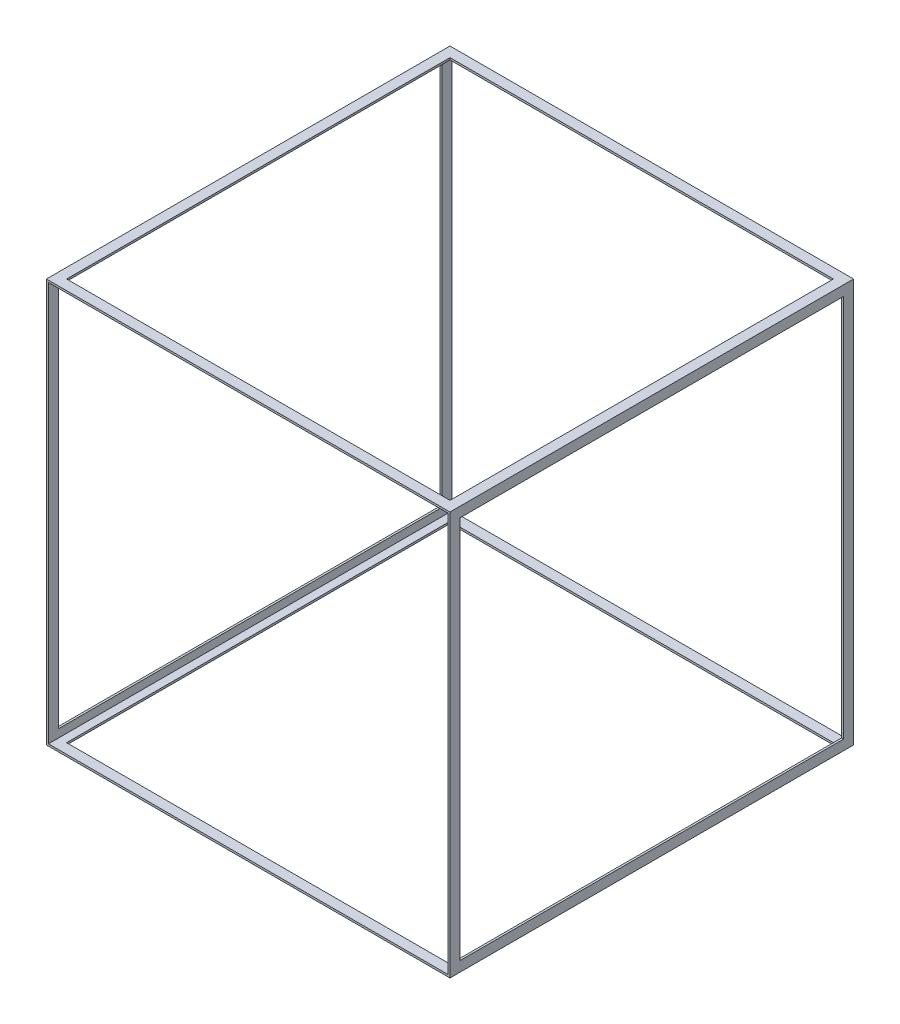
ISO-10303-21;
HEADER;
FILE_DESCRIPTION(('STEP AP214'),'2;1');
FILE_NAME('part.step','',(''),(''),'','','');
FILE_SCHEMA(('AUTOMOTIVE_DESIGN { 1 0 10303 214 1 1 1 1 }'));
ENDSEC;
DATA;
#1=APPLICATION_CONTEXT('core data for automotive mechanical design processes');
#2=APPLICATION_PROTOCOL_DEFINITION('international standard','automotive_design',2000,#1);
#3=PRODUCT_CONTEXT('',#1,'mechanical');
#4=PRODUCT('Part','Part','',(#3));
#5=PRODUCT_RELATED_PRODUCT_CATEGORY('part','',(#4));
#6=PRODUCT_DEFINITION_FORMATION('','',#4);
#7=PRODUCT_DEFINITION_CONTEXT('part definition',#1,'design');
#8=PRODUCT_DEFINITION('design','',#6,#7);
#9=PRODUCT_DEFINITION_SHAPE('','',#8);
#10=(LENGTH_UNIT() NAMED_UNIT(*) SI_UNIT(.MILLI.,.METRE.));
#11=(NAMED_UNIT(*) PLANE_ANGLE_UNIT() SI_UNIT($,.RADIAN.));
#12=(NAMED_UNIT(*) SI_UNIT($,.STERADIAN.) SOLID_ANGLE_UNIT());
#13=UNCERTAINTY_MEASURE_WITH_UNIT(LENGTH_MEASURE(1.E-05),#10,'distance_accuracy_value','');
#14=(GEOMETRIC_REPRESENTATION_CONTEXT(3) GLOBAL_UNCERTAINTY_ASSIGNED_CONTEXT((#13)) GLOBAL_UNIT_ASSIGNED_CONTEXT((#10,
#11,#12)) REPRESENTATION_CONTEXT('',''));
#15=CARTESIAN_POINT('',(0.,0.,0.));
#16=DIRECTION('',(0.,0.,1.));
#17=DIRECTION('',(1.,0.,0.));
#18=AXIS2_PLACEMENT_3D('',#15,#16,#17);
#19=CARTESIAN_POINT('',(0.,0.,20000.));
#20=DIRECTION('',(0.,0.,-1.));
#21=DIRECTION('',(-1.,0.,0.));
#22=AXIS2_PLACEMENT_3D('',#19,#20,#21);
#23=PLANE('',#22);
#24=DIRECTION('',(0.,-1.,0.));
#25=VECTOR('',#24,1.);
#26=CARTESIAN_POINT('',(0.,0.,20000.));
#27=LINE('',#26,#25);
#28=CARTESIAN_POINT('',(0.,20000.,20000.));
#29=VERTEX_POINT('',#28);
#30=CARTESIAN_POINT('',(0.,0.,20000.));
#31=VERTEX_POINT('',#30);
#32=EDGE_CURVE('E380',#29,#31,#27,.T.);
#33=ORIENTED_EDGE('',*,*,#32,.T.);
#34=DIRECTION('',(1.,0.,0.));
#35=VECTOR('',#34,1.);
#36=CARTESIAN_POINT('',(0.,0.,20000.));
#37=LINE('',#36,#35);
#38=CARTESIAN_POINT('',(20000.,0.,20000.));
#39=VERTEX_POINT('',#38);
#40=EDGE_CURVE('E384',#31,#39,#37,.T.);
#41=ORIENTED_EDGE('',*,*,#40,.T.);
#42=DIRECTION('',(0.,1.,0.));
#43=VECTOR('',#42,1.);
#44=CARTESIAN_POINT('',(20000.,0.,20000.));
#45=LINE('',#44,#43);
#46=CARTESIAN_POINT('',(20000.,20000.,20000.));
#47=VERTEX_POINT('',#46);
#48=EDGE_CURVE('E388',#39,#47,#45,.T.);
#49=ORIENTED_EDGE('',*,*,#48,.T.);
#50=DIRECTION('',(-1.,0.,0.));
#51=VECTOR('',#50,1.);
#52=CARTESIAN_POINT('',(0.,20000.,20000.));
#53=LINE('',#52,#51);
#54=EDGE_CURVE('E391',#47,#29,#53,.T.);
#55=ORIENTED_EDGE('',*,*,#54,.T.);
#56=EDGE_LOOP('',(#33,#41,#49,#55));
#57=FACE_BOUND('',#56,.T.);
#58=DIRECTION('',(1.,0.,0.));
#59=VECTOR('',#58,1.);
#60=CARTESIAN_POINT('',(100.,100.,20000.));
#61=LINE('',#60,#59);
#62=CARTESIAN_POINT('',(100.,100.,20000.));
#63=VERTEX_POINT('',#62);
#64=CARTESIAN_POINT('',(19900.,100.,20000.));
#65=VERTEX_POINT('',#64);
#66=EDGE_CURVE('E337',#63,#65,#61,.T.);
#67=ORIENTED_EDGE('',*,*,#66,.F.);
#68=DIRECTION('',(0.,-1.,0.));
#69=VECTOR('',#68,1.);
#70=CARTESIAN_POINT('',(100.,100.,20000.));
#71=LINE('',#70,#69);
#72=CARTESIAN_POINT('',(100.,19900.,20000.));
#73=VERTEX_POINT('',#72);
#74=EDGE_CURVE('E348',#73,#63,#71,.T.);
#75=ORIENTED_EDGE('',*,*,#74,.F.);
#76=DIRECTION('',(-1.,0.,0.));
#77=VECTOR('',#76,1.);
#78=CARTESIAN_POINT('',(100.,19900.,20000.));
#79=LINE('',#78,#77);
#80=CARTESIAN_POINT('',(19900.,19900.,20000.));
#81=VERTEX_POINT('',#80);
#82=EDGE_CURVE('E344',#81,#73,#79,.T.);
#83=ORIENTED_EDGE('',*,*,#82,.F.);
#84=DIRECTION('',(0.,1.,0.));
#85=VECTOR('',#84,1.);
#86=CARTESIAN_POINT('',(19900.,100.,20000.));
#87=LINE('',#86,#85);
#88=EDGE_CURVE('E340',#65,#81,#87,.T.);
#89=ORIENTED_EDGE('',*,*,#88,.F.);
#90=EDGE_LOOP('',(#67,#75,#83,#89));
#91=FACE_BOUND('',#90,.T.);
#92=ADVANCED_FACE('F39',(#57,#91),#23,.F.);
#93=CARTESIAN_POINT('',(0.,0.,0.));
#94=DIRECTION('',(0.,0.,-1.));
#95=DIRECTION('',(-1.,0.,0.));
#96=AXIS2_PLACEMENT_3D('',#93,#94,#95);
#97=PLANE('',#96);
#98=DIRECTION('',(0.,-1.,0.));
#99=VECTOR('',#98,1.);
#100=CARTESIAN_POINT('',(0.,0.,0.));
#101=LINE('',#100,#99);
#102=CARTESIAN_POINT('',(0.,20000.,0.));
#103=VERTEX_POINT('',#102);
#104=CARTESIAN_POINT('',(0.,0.,0.));
#105=VERTEX_POINT('',#104);
#106=EDGE_CURVE('E379',#103,#105,#101,.T.);
#107=ORIENTED_EDGE('',*,*,#106,.F.);
#108=DIRECTION('',(-1.,0.,0.));
#109=VECTOR('',#108,1.);
#110=CARTESIAN_POINT('',(0.,20000.,0.));
#111=LINE('',#110,#109);
#112=CARTESIAN_POINT('',(20000.,20000.,0.));
#113=VERTEX_POINT('',#112);
#114=EDGE_CURVE('E385',#113,#103,#111,.T.);
#115=ORIENTED_EDGE('',*,*,#114,.F.);
#116=DIRECTION('',(0.,1.,0.));
#117=VECTOR('',#116,1.);
#118=CARTESIAN_POINT('',(20000.,0.,0.));
#119=LINE('',#118,#117);
#120=CARTESIAN_POINT('',(20000.,0.,0.));
#121=VERTEX_POINT('',#120);
#122=EDGE_CURVE('E401',#121,#113,#119,.T.);
#123=ORIENTED_EDGE('',*,*,#122,.F.);
#124=DIRECTION('',(1.,0.,0.));
#125=VECTOR('',#124,1.);
#126=CARTESIAN_POINT('',(0.,0.,0.));
#127=LINE('',#126,#125);
#128=EDGE_CURVE('E398',#105,#121,#127,.T.);
#129=ORIENTED_EDGE('',*,*,#128,.F.);
#130=EDGE_LOOP('',(#107,#115,#123,#129));
#131=FACE_BOUND('',#130,.T.);
#132=DIRECTION('',(0.,-1.,0.));
#133=VECTOR('',#132,1.);
#134=CARTESIAN_POINT('',(100.,100.,0.));
#135=LINE('',#134,#133);
#136=CARTESIAN_POINT('',(100.,19900.,0.));
#137=VERTEX_POINT('',#136);
#138=CARTESIAN_POINT('',(100.,100.,0.));
#139=VERTEX_POINT('',#138);
#140=EDGE_CURVE('E341',#137,#139,#135,.T.);
#141=ORIENTED_EDGE('',*,*,#140,.T.);
#142=DIRECTION('',(1.,0.,0.));
#143=VECTOR('',#142,1.);
#144=CARTESIAN_POINT('',(100.,100.,0.));
#145=LINE('',#144,#143);
#146=CARTESIAN_POINT('',(19900.,100.,0.));
#147=VERTEX_POINT('',#146);
#148=EDGE_CURVE('E336',#139,#147,#145,.T.);
#149=ORIENTED_EDGE('',*,*,#148,.T.);
#150=DIRECTION('',(0.,1.,0.));
#151=VECTOR('',#150,1.);
#152=CARTESIAN_POINT('',(19900.,100.,0.));
#153=LINE('',#152,#151);
#154=CARTESIAN_POINT('',(19900.,19900.,0.));
#155=VERTEX_POINT('',#154);
#156=EDGE_CURVE('E355',#147,#155,#153,.T.);
#157=ORIENTED_EDGE('',*,*,#156,.T.);
#158=DIRECTION('',(-1.,0.,0.));
#159=VECTOR('',#158,1.);
#160=CARTESIAN_POINT('',(100.,19900.,0.));
#161=LINE('',#160,#159);
#162=EDGE_CURVE('E359',#155,#137,#161,.T.);
#163=ORIENTED_EDGE('',*,*,#162,.T.);
#164=EDGE_LOOP('',(#141,#149,#157,#163));
#165=FACE_BOUND('',#164,.T.);
#166=ADVANCED_FACE('F463',(#131,#165),#97,.T.);
#167=CARTESIAN_POINT('',(0.,0.,20000.));
#168=DIRECTION('',(1.,0.,0.));
#169=DIRECTION('',(0.,0.,-1.));
#170=AXIS2_PLACEMENT_3D('',#167,#168,#169);
#171=PLANE('',#170);
#172=DIRECTION('',(0.,0.,1.));
#173=VECTOR('',#172,1.);
#174=CARTESIAN_POINT('',(0.,19500.,20000.));
#175=LINE('',#174,#173);
#176=CARTESIAN_POINT('',(0.,19500.,500.));
#177=VERTEX_POINT('',#176);
#178=CARTESIAN_POINT('',(0.,19500.,19500.));
#179=VERTEX_POINT('',#178);
#180=EDGE_CURVE('E310',#177,#179,#175,.T.);
#181=ORIENTED_EDGE('',*,*,#180,.T.);
#182=DIRECTION('',(0.,-1.,0.));
#183=VECTOR('',#182,1.);
#184=CARTESIAN_POINT('',(0.,0.,19500.));
#185=LINE('',#184,#183);
#186=CARTESIAN_POINT('',(0.,500.,19500.));
#187=VERTEX_POINT('',#186);
#188=EDGE_CURVE('E332',#179,#187,#185,.T.);
#189=ORIENTED_EDGE('',*,*,#188,.T.);
#190=DIRECTION('',(0.,0.,-1.));
#191=VECTOR('',#190,1.);
#192=CARTESIAN_POINT('',(0.,500.,20000.));
#193=LINE('',#192,#191);
#194=CARTESIAN_POINT('',(0.,499.999999999998,500.000000000004));
#195=VERTEX_POINT('',#194);
#196=EDGE_CURVE('E324',#187,#195,#193,.T.);
#197=ORIENTED_EDGE('',*,*,#196,.T.);
#198=DIRECTION('',(0.,1.,0.));
#199=VECTOR('',#198,1.);
#200=CARTESIAN_POINT('',(0.,-3.70317811503259E-12,500.000000000004));
#201=LINE('',#200,#199);
#202=EDGE_CURVE('E317',#195,#177,#201,.T.);
#203=ORIENTED_EDGE('',*,*,#202,.T.);
#204=EDGE_LOOP('',(#181,#189,#197,#203));
#205=FACE_BOUND('',#204,.T.);
#206=ORIENTED_EDGE('',*,*,#106,.T.);
#207=DIRECTION('',(0.,0.,-1.));
#208=VECTOR('',#207,1.);
#209=CARTESIAN_POINT('',(0.,0.,20000.));
#210=LINE('',#209,#208);
#211=EDGE_CURVE('E417',#31,#105,#210,.T.);
#212=ORIENTED_EDGE('',*,*,#211,.F.);
#213=ORIENTED_EDGE('',*,*,#32,.F.);
#214=DIRECTION('',(0.,0.,-1.));
#215=VECTOR('',#214,1.);
#216=CARTESIAN_POINT('',(0.,20000.,20000.));
#217=LINE('',#216,#215);
#218=EDGE_CURVE('E394',#29,#103,#217,.T.);
#219=ORIENTED_EDGE('',*,*,#218,.T.);
#220=EDGE_LOOP('',(#206,#212,#213,#219));
#221=FACE_BOUND('',#220,.T.);
#222=ADVANCED_FACE('F41',(#205,#221),#171,.F.);
#223=CARTESIAN_POINT('',(0.,0.,20000.));
#224=DIRECTION('',(0.,1.,0.));
#225=DIRECTION('',(0.,0.,1.));
#226=AXIS2_PLACEMENT_3D('',#223,#224,#225);
#227=PLANE('',#226);
#228=DIRECTION('',(1.,0.,0.));
#229=VECTOR('',#228,1.);
#230=CARTESIAN_POINT('',(500.000000000002,0.,500.));
#231=LINE('',#230,#229);
#232=CARTESIAN_POINT('',(500.000000000002,0.,500.));
#233=VERTEX_POINT('',#232);
#234=CARTESIAN_POINT('',(19500.,0.,500.));
#235=VERTEX_POINT('',#234);
#236=EDGE_CURVE('E241',#233,#235,#231,.T.);
#237=ORIENTED_EDGE('',*,*,#236,.F.);
#238=DIRECTION('',(0.,0.,-1.));
#239=VECTOR('',#238,1.);
#240=CARTESIAN_POINT('',(500.,0.,19500.));
#241=LINE('',#240,#239);
#242=CARTESIAN_POINT('',(500.,0.,19500.));
#243=VERTEX_POINT('',#242);
#244=EDGE_CURVE('E55',#243,#233,#241,.T.);
#245=ORIENTED_EDGE('',*,*,#244,.F.);
#246=DIRECTION('',(-1.,0.,0.));
#247=VECTOR('',#246,1.);
#248=CARTESIAN_POINT('',(500.,0.,19500.));
#249=LINE('',#248,#247);
#250=CARTESIAN_POINT('',(19500.,0.,19500.));
#251=VERTEX_POINT('',#250);
#252=EDGE_CURVE('E228',#251,#243,#249,.T.);
#253=ORIENTED_EDGE('',*,*,#252,.F.);
#254=DIRECTION('',(0.,0.,1.));
#255=VECTOR('',#254,1.);
#256=CARTESIAN_POINT('',(19500.,0.,19500.));
#257=LINE('',#256,#255);
#258=EDGE_CURVE('E232',#235,#251,#257,.T.);
#259=ORIENTED_EDGE('',*,*,#258,.F.);
#260=EDGE_LOOP('',(#237,#245,#253,#259));
#261=FACE_BOUND('',#260,.T.);
#262=ORIENTED_EDGE('',*,*,#128,.T.);
#263=DIRECTION('',(0.,0.,-1.));
#264=VECTOR('',#263,1.);
#265=CARTESIAN_POINT('',(20000.,0.,20000.));
#266=LINE('',#265,#264);
#267=EDGE_CURVE('E413',#39,#121,#266,.T.);
#268=ORIENTED_EDGE('',*,*,#267,.F.);
#269=ORIENTED_EDGE('',*,*,#40,.F.);
#270=ORIENTED_EDGE('',*,*,#211,.T.);
#271=EDGE_LOOP('',(#262,#268,#269,#270));
#272=FACE_BOUND('',#271,.T.);
#273=ADVANCED_FACE('F480',(#261,#272),#227,.F.);
#274=CARTESIAN_POINT('',(20000.,0.,20000.));
#275=DIRECTION('',(-1.,0.,0.));
#276=DIRECTION('',(0.,0.,1.));
#277=AXIS2_PLACEMENT_3D('',#274,#275,#276);
#278=PLANE('',#277);
#279=DIRECTION('',(0.,0.,1.));
#280=VECTOR('',#279,1.);
#281=CARTESIAN_POINT('',(20000.,500.,19500.));
#282=LINE('',#281,#280);
#283=CARTESIAN_POINT('',(20000.,499.999999999998,500.000000000004));
#284=VERTEX_POINT('',#283);
#285=CARTESIAN_POINT('',(20000.,500.,19500.));
#286=VERTEX_POINT('',#285);
#287=EDGE_CURVE('E284',#284,#286,#282,.T.);
#288=ORIENTED_EDGE('',*,*,#287,.T.);
#289=DIRECTION('',(0.,1.,0.));
#290=VECTOR('',#289,1.);
#291=CARTESIAN_POINT('',(20000.,19500.,19500.));
#292=LINE('',#291,#290);
#293=CARTESIAN_POINT('',(20000.,19500.,19500.));
#294=VERTEX_POINT('',#293);
#295=EDGE_CURVE('E272',#286,#294,#292,.T.);
#296=ORIENTED_EDGE('',*,*,#295,.T.);
#297=DIRECTION('',(0.,0.,-1.));
#298=VECTOR('',#297,1.);
#299=CARTESIAN_POINT('',(20000.,19500.,19500.));
#300=LINE('',#299,#298);
#301=CARTESIAN_POINT('',(20000.,19500.,500.));
#302=VERTEX_POINT('',#301);
#303=EDGE_CURVE('E276',#294,#302,#300,.T.);
#304=ORIENTED_EDGE('',*,*,#303,.T.);
#305=DIRECTION('',(0.,-1.,0.));
#306=VECTOR('',#305,1.);
#307=CARTESIAN_POINT('',(20000.,19500.,500.));
#308=LINE('',#307,#306);
#309=EDGE_CURVE('E280',#302,#284,#308,.T.);
#310=ORIENTED_EDGE('',*,*,#309,.T.);
#311=EDGE_LOOP('',(#288,#296,#304,#310));
#312=FACE_BOUND('',#311,.T.);
#313=ORIENTED_EDGE('',*,*,#122,.T.);
#314=DIRECTION('',(0.,0.,-1.));
#315=VECTOR('',#314,1.);
#316=CARTESIAN_POINT('',(20000.,20000.,20000.));
#317=LINE('',#316,#315);
#318=EDGE_CURVE('E409',#47,#113,#317,.T.);
#319=ORIENTED_EDGE('',*,*,#318,.F.);
#320=ORIENTED_EDGE('',*,*,#48,.F.);
#321=ORIENTED_EDGE('',*,*,#267,.T.);
#322=EDGE_LOOP('',(#313,#319,#320,#321));
#323=FACE_BOUND('',#322,.T.);
#324=ADVANCED_FACE('F478',(#312,#323),#278,.F.);
#325=CARTESIAN_POINT('',(0.,20000.,20000.));
#326=DIRECTION('',(0.,-1.,0.));
#327=DIRECTION('',(0.,0.,-1.));
#328=AXIS2_PLACEMENT_3D('',#325,#326,#327);
#329=PLANE('',#328);
#330=DIRECTION('',(-1.,0.,0.));
#331=VECTOR('',#330,1.);
#332=CARTESIAN_POINT('',(500.,20000.,19500.));
#333=LINE('',#332,#331);
#334=CARTESIAN_POINT('',(19500.,20000.,19500.));
#335=VERTEX_POINT('',#334);
#336=CARTESIAN_POINT('',(500.,20000.,19500.));
#337=VERTEX_POINT('',#336);
#338=EDGE_CURVE('E226',#335,#337,#333,.T.);
#339=ORIENTED_EDGE('',*,*,#338,.T.);
#340=DIRECTION('',(0.,0.,-1.));
#341=VECTOR('',#340,1.);
#342=CARTESIAN_POINT('',(500.,20000.,19500.));
#343=LINE('',#342,#341);
#344=CARTESIAN_POINT('',(500.000000000002,20000.,500.));
#345=VERTEX_POINT('',#344);
#346=EDGE_CURVE('E207',#337,#345,#343,.T.);
#347=ORIENTED_EDGE('',*,*,#346,.T.);
#348=DIRECTION('',(1.,0.,0.));
#349=VECTOR('',#348,1.);
#350=CARTESIAN_POINT('',(500.000000000002,20000.,500.));
#351=LINE('',#350,#349);
#352=CARTESIAN_POINT('',(19500.,20000.,500.));
#353=VERTEX_POINT('',#352);
#354=EDGE_CURVE('E217',#345,#353,#351,.T.);
#355=ORIENTED_EDGE('',*,*,#354,.T.);
#356=DIRECTION('',(0.,0.,1.));
#357=VECTOR('',#356,1.);
#358=CARTESIAN_POINT('',(19500.,20000.,19500.));
#359=LINE('',#358,#357);
#360=EDGE_CURVE('E63',#353,#335,#359,.T.);
#361=ORIENTED_EDGE('',*,*,#360,.T.);
#362=EDGE_LOOP('',(#339,#347,#355,#361));
#363=FACE_BOUND('',#362,.T.);
#364=ORIENTED_EDGE('',*,*,#114,.T.);
#365=ORIENTED_EDGE('',*,*,#218,.F.);
#366=ORIENTED_EDGE('',*,*,#54,.F.);
#367=ORIENTED_EDGE('',*,*,#318,.T.);
#368=EDGE_LOOP('',(#364,#365,#366,#367));
#369=FACE_BOUND('',#368,.T.);
#370=ADVANCED_FACE('F223',(#363,#369),#329,.F.);
#371=CARTESIAN_POINT('',(100.,100.,20000.));
#372=DIRECTION('',(0.,1.,0.));
#373=DIRECTION('',(0.,0.,1.));
#374=AXIS2_PLACEMENT_3D('',#371,#372,#373);
#375=PLANE('',#374);
#376=DIRECTION('',(0.,0.,1.));
#377=VECTOR('',#376,1.);
#378=CARTESIAN_POINT('',(500.,100.,20000.));
#379=LINE('',#378,#377);
#380=CARTESIAN_POINT('',(500.000000000002,100.000000000001,500.));
#381=VERTEX_POINT('',#380);
#382=CARTESIAN_POINT('',(500.,100.000000000001,19500.));
#383=VERTEX_POINT('',#382);
#384=EDGE_CURVE('E269',#381,#383,#379,.T.);
#385=ORIENTED_EDGE('',*,*,#384,.F.);
#386=DIRECTION('',(-1.,0.,0.));
#387=VECTOR('',#386,1.);
#388=CARTESIAN_POINT('',(100.,100.,500.));
#389=LINE('',#388,#387);
#390=CARTESIAN_POINT('',(19500.,100.,500.));
#391=VERTEX_POINT('',#390);
#392=EDGE_CURVE('E251',#391,#381,#389,.T.);
#393=ORIENTED_EDGE('',*,*,#392,.F.);
#394=DIRECTION('',(0.,0.,-1.));
#395=VECTOR('',#394,1.);
#396=CARTESIAN_POINT('',(19500.,100.,20000.));
#397=LINE('',#396,#395);
#398=CARTESIAN_POINT('',(19500.,100.000000000001,19500.));
#399=VERTEX_POINT('',#398);
#400=EDGE_CURVE('E262',#399,#391,#397,.T.);
#401=ORIENTED_EDGE('',*,*,#400,.F.);
#402=DIRECTION('',(1.,0.,0.));
#403=VECTOR('',#402,1.);
#404=CARTESIAN_POINT('',(100.,100.,19500.));
#405=LINE('',#404,#403);
#406=EDGE_CURVE('E266',#383,#399,#405,.T.);
#407=ORIENTED_EDGE('',*,*,#406,.F.);
#408=EDGE_LOOP('',(#385,#393,#401,#407));
#409=FACE_BOUND('',#408,.T.);
#410=ORIENTED_EDGE('',*,*,#148,.F.);
#411=DIRECTION('',(0.,0.,-1.));
#412=VECTOR('',#411,1.);
#413=CARTESIAN_POINT('',(100.,100.,20000.));
#414=LINE('',#413,#412);
#415=EDGE_CURVE('E351',#63,#139,#414,.T.);
#416=ORIENTED_EDGE('',*,*,#415,.F.);
#417=ORIENTED_EDGE('',*,*,#66,.T.);
#418=DIRECTION('',(0.,0.,-1.));
#419=VECTOR('',#418,1.);
#420=CARTESIAN_POINT('',(19900.,100.,20000.));
#421=LINE('',#420,#419);
#422=EDGE_CURVE('E375',#65,#147,#421,.T.);
#423=ORIENTED_EDGE('',*,*,#422,.T.);
#424=EDGE_LOOP('',(#410,#416,#417,#423));
#425=FACE_BOUND('',#424,.T.);
#426=ADVANCED_FACE('F473',(#409,#425),#375,.T.);
#427=CARTESIAN_POINT('',(19900.,100.,20000.));
#428=DIRECTION('',(-1.,0.,0.));
#429=DIRECTION('',(0.,0.,1.));
#430=AXIS2_PLACEMENT_3D('',#427,#428,#429);
#431=PLANE('',#430);
#432=DIRECTION('',(0.,1.,0.));
#433=VECTOR('',#432,1.);
#434=CARTESIAN_POINT('',(19900.,99.9999999999999,19500.));
#435=LINE('',#434,#433);
#436=CARTESIAN_POINT('',(19900.,500.,19500.));
#437=VERTEX_POINT('',#436);
#438=CARTESIAN_POINT('',(19900.,19500.,19500.));
#439=VERTEX_POINT('',#438);
#440=EDGE_CURVE('E328',#437,#439,#435,.T.);
#441=ORIENTED_EDGE('',*,*,#440,.F.);
#442=DIRECTION('',(0.,0.,1.));
#443=VECTOR('',#442,1.);
#444=CARTESIAN_POINT('',(19900.,500.,20000.));
#445=LINE('',#444,#443);
#446=CARTESIAN_POINT('',(19900.,499.999999999998,500.000000000004));
#447=VERTEX_POINT('',#446);
#448=EDGE_CURVE('E321',#447,#437,#445,.T.);
#449=ORIENTED_EDGE('',*,*,#448,.F.);
#450=DIRECTION('',(0.,-1.,0.));
#451=VECTOR('',#450,1.);
#452=CARTESIAN_POINT('',(19900.,99.9999999999963,500.000000000004));
#453=LINE('',#452,#451);
#454=CARTESIAN_POINT('',(19900.,19500.,500.));
#455=VERTEX_POINT('',#454);
#456=EDGE_CURVE('E314',#455,#447,#453,.T.);
#457=ORIENTED_EDGE('',*,*,#456,.F.);
#458=DIRECTION('',(0.,0.,-1.));
#459=VECTOR('',#458,1.);
#460=CARTESIAN_POINT('',(19900.,19500.,20000.));
#461=LINE('',#460,#459);
#462=EDGE_CURVE('E293',#439,#455,#461,.T.);
#463=ORIENTED_EDGE('',*,*,#462,.F.);
#464=EDGE_LOOP('',(#441,#449,#457,#463));
#465=FACE_BOUND('',#464,.T.);
#466=ORIENTED_EDGE('',*,*,#156,.F.);
#467=ORIENTED_EDGE('',*,*,#422,.F.);
#468=ORIENTED_EDGE('',*,*,#88,.T.);
#469=DIRECTION('',(0.,0.,-1.));
#470=VECTOR('',#469,1.);
#471=CARTESIAN_POINT('',(19900.,19900.,20000.));
#472=LINE('',#471,#470);
#473=EDGE_CURVE('E372',#81,#155,#472,.T.);
#474=ORIENTED_EDGE('',*,*,#473,.T.);
#475=EDGE_LOOP('',(#466,#467,#468,#474));
#476=FACE_BOUND('',#475,.T.);
#477=ADVANCED_FACE('F517',(#465,#476),#431,.T.);
#478=CARTESIAN_POINT('',(100.,19900.,20000.));
#479=DIRECTION('',(0.,-1.,0.));
#480=DIRECTION('',(0.,0.,-1.));
#481=AXIS2_PLACEMENT_3D('',#478,#479,#480);
#482=PLANE('',#481);
#483=DIRECTION('',(0.,0.,-1.));
#484=VECTOR('',#483,1.);
#485=CARTESIAN_POINT('',(500.,19900.,20000.));
#486=LINE('',#485,#484);
#487=CARTESIAN_POINT('',(500.,19900.,19500.));
#488=VERTEX_POINT('',#487);
#489=CARTESIAN_POINT('',(500.000000000002,19900.,500.));
#490=VERTEX_POINT('',#489);
#491=EDGE_CURVE('E11',#488,#490,#486,.T.);
#492=ORIENTED_EDGE('',*,*,#491,.F.);
#493=DIRECTION('',(-1.,0.,0.));
#494=VECTOR('',#493,1.);
#495=CARTESIAN_POINT('',(100.,19900.,19500.));
#496=LINE('',#495,#494);
#497=CARTESIAN_POINT('',(19500.,19900.,19500.));
#498=VERTEX_POINT('',#497);
#499=EDGE_CURVE('E48',#498,#488,#496,.T.);
#500=ORIENTED_EDGE('',*,*,#499,.F.);
#501=DIRECTION('',(0.,0.,1.));
#502=VECTOR('',#501,1.);
#503=CARTESIAN_POINT('',(19500.,19900.,20000.));
#504=LINE('',#503,#502);
#505=CARTESIAN_POINT('',(19500.,19900.,500.));
#506=VERTEX_POINT('',#505);
#507=EDGE_CURVE('E437',#506,#498,#504,.T.);
#508=ORIENTED_EDGE('',*,*,#507,.F.);
#509=DIRECTION('',(1.,0.,0.));
#510=VECTOR('',#509,1.);
#511=CARTESIAN_POINT('',(100.,19900.,500.));
#512=LINE('',#511,#510);
#513=EDGE_CURVE('E434',#490,#506,#512,.T.);
#514=ORIENTED_EDGE('',*,*,#513,.F.);
#515=EDGE_LOOP('',(#492,#500,#508,#514));
#516=FACE_BOUND('',#515,.T.);
#517=ORIENTED_EDGE('',*,*,#162,.F.);
#518=ORIENTED_EDGE('',*,*,#473,.F.);
#519=ORIENTED_EDGE('',*,*,#82,.T.);
#520=DIRECTION('',(0.,0.,-1.));
#521=VECTOR('',#520,1.);
#522=CARTESIAN_POINT('',(100.,19900.,20000.));
#523=LINE('',#522,#521);
#524=EDGE_CURVE('E369',#73,#137,#523,.T.);
#525=ORIENTED_EDGE('',*,*,#524,.T.);
#526=EDGE_LOOP('',(#517,#518,#519,#525));
#527=FACE_BOUND('',#526,.T.);
#528=ADVANCED_FACE('F445',(#516,#527),#482,.T.);
#529=CARTESIAN_POINT('',(100.,100.,20000.));
#530=DIRECTION('',(1.,0.,0.));
#531=DIRECTION('',(0.,0.,-1.));
#532=AXIS2_PLACEMENT_3D('',#529,#530,#531);
#533=PLANE('',#532);
#534=DIRECTION('',(0.,-1.,0.));
#535=VECTOR('',#534,1.);
#536=CARTESIAN_POINT('',(100.,99.9999999999999,19500.));
#537=LINE('',#536,#535);
#538=CARTESIAN_POINT('',(100.000000000001,19500.,19500.));
#539=VERTEX_POINT('',#538);
#540=CARTESIAN_POINT('',(100.000000000001,500.,19500.));
#541=VERTEX_POINT('',#540);
#542=EDGE_CURVE('E431',#539,#541,#537,.T.);
#543=ORIENTED_EDGE('',*,*,#542,.F.);
#544=DIRECTION('',(0.,0.,1.));
#545=VECTOR('',#544,1.);
#546=CARTESIAN_POINT('',(100.,19500.,20000.));
#547=LINE('',#546,#545);
#548=CARTESIAN_POINT('',(100.,19500.,500.));
#549=VERTEX_POINT('',#548);
#550=EDGE_CURVE('E421',#549,#539,#547,.T.);
#551=ORIENTED_EDGE('',*,*,#550,.F.);
#552=DIRECTION('',(0.,1.,0.));
#553=VECTOR('',#552,1.);
#554=CARTESIAN_POINT('',(100.,99.9999999999963,500.000000000004));
#555=LINE('',#554,#553);
#556=CARTESIAN_POINT('',(100.000000000001,499.999999999998,500.000000000004));
#557=VERTEX_POINT('',#556);
#558=EDGE_CURVE('E424',#557,#549,#555,.T.);
#559=ORIENTED_EDGE('',*,*,#558,.F.);
#560=DIRECTION('',(0.,0.,-1.));
#561=VECTOR('',#560,1.);
#562=CARTESIAN_POINT('',(100.,500.,20000.));
#563=LINE('',#562,#561);
#564=EDGE_CURVE('E428',#541,#557,#563,.T.);
#565=ORIENTED_EDGE('',*,*,#564,.F.);
#566=EDGE_LOOP('',(#543,#551,#559,#565));
#567=FACE_BOUND('',#566,.T.);
#568=ORIENTED_EDGE('',*,*,#140,.F.);
#569=ORIENTED_EDGE('',*,*,#524,.F.);
#570=ORIENTED_EDGE('',*,*,#74,.T.);
#571=ORIENTED_EDGE('',*,*,#415,.T.);
#572=EDGE_LOOP('',(#568,#569,#570,#571));
#573=FACE_BOUND('',#572,.T.);
#574=ADVANCED_FACE('F507',(#567,#573),#533,.T.);
#575=CARTESIAN_POINT('',(20000.,19500.,19500.));
#576=DIRECTION('',(0.,1.,0.));
#577=DIRECTION('',(0.,0.,1.));
#578=AXIS2_PLACEMENT_3D('',#575,#576,#577);
#579=PLANE('',#578);
#580=DIRECTION('',(-1.,0.,0.));
#581=VECTOR('',#580,1.);
#582=CARTESIAN_POINT('',(20000.,19500.,500.));
#583=LINE('',#582,#581);
#584=EDGE_CURVE('E304',#549,#177,#583,.T.);
#585=ORIENTED_EDGE('',*,*,#584,.F.);
#586=ORIENTED_EDGE('',*,*,#550,.T.);
#587=DIRECTION('',(-1.,0.,0.));
#588=VECTOR('',#587,1.);
#589=CARTESIAN_POINT('',(20000.,19500.,19500.));
#590=LINE('',#589,#588);
#591=EDGE_CURVE('E288',#539,#179,#590,.T.);
#592=ORIENTED_EDGE('',*,*,#591,.T.);
#593=ORIENTED_EDGE('',*,*,#180,.F.);
#594=EDGE_LOOP('',(#585,#586,#592,#593));
#595=FACE_BOUND('',#594,.T.);
#596=ADVANCED_FACE('F524',(#595),#579,.F.);
#597=CARTESIAN_POINT('',(20000.,19500.,500.));
#598=DIRECTION('',(0.,0.,-1.));
#599=DIRECTION('',(0.,1.,0.));
#600=AXIS2_PLACEMENT_3D('',#597,#598,#599);
#601=PLANE('',#600);
#602=DIRECTION('',(-1.,0.,0.));
#603=VECTOR('',#602,1.);
#604=CARTESIAN_POINT('',(20000.,499.999999999998,500.000000000004));
#605=LINE('',#604,#603);
#606=EDGE_CURVE('E299',#557,#195,#605,.T.);
#607=ORIENTED_EDGE('',*,*,#606,.F.);
#608=ORIENTED_EDGE('',*,*,#558,.T.);
#609=ORIENTED_EDGE('',*,*,#584,.T.);
#610=ORIENTED_EDGE('',*,*,#202,.F.);
#611=EDGE_LOOP('',(#607,#608,#609,#610));
#612=FACE_BOUND('',#611,.T.);
#613=ADVANCED_FACE('F537',(#612),#601,.F.);
#614=CARTESIAN_POINT('',(20000.,500.,19500.));
#615=DIRECTION('',(0.,-1.,0.));
#616=DIRECTION('',(0.,0.,-1.));
#617=AXIS2_PLACEMENT_3D('',#614,#615,#616);
#618=PLANE('',#617);
#619=DIRECTION('',(-1.,0.,0.));
#620=VECTOR('',#619,1.);
#621=CARTESIAN_POINT('',(20000.,500.,19500.));
#622=LINE('',#621,#620);
#623=EDGE_CURVE('E294',#541,#187,#622,.T.);
#624=ORIENTED_EDGE('',*,*,#623,.F.);
#625=ORIENTED_EDGE('',*,*,#564,.T.);
#626=ORIENTED_EDGE('',*,*,#606,.T.);
#627=ORIENTED_EDGE('',*,*,#196,.F.);
#628=EDGE_LOOP('',(#624,#625,#626,#627));
#629=FACE_BOUND('',#628,.T.);
#630=ADVANCED_FACE('F533',(#629),#618,.F.);
#631=CARTESIAN_POINT('',(20000.,19500.,19500.));
#632=DIRECTION('',(0.,0.,1.));
#633=DIRECTION('',(0.,-1.,0.));
#634=AXIS2_PLACEMENT_3D('',#631,#632,#633);
#635=PLANE('',#634);
#636=ORIENTED_EDGE('',*,*,#591,.F.);
#637=ORIENTED_EDGE('',*,*,#542,.T.);
#638=ORIENTED_EDGE('',*,*,#623,.T.);
#639=ORIENTED_EDGE('',*,*,#188,.F.);
#640=EDGE_LOOP('',(#636,#637,#638,#639));
#641=FACE_BOUND('',#640,.T.);
#642=ADVANCED_FACE('F529',(#641),#635,.F.);
#643=ORIENTED_EDGE('',*,*,#440,.T.);
#644=EDGE_CURVE('E305',#294,#439,#590,.T.);
#645=ORIENTED_EDGE('',*,*,#644,.F.);
#646=ORIENTED_EDGE('',*,*,#295,.F.);
#647=EDGE_CURVE('E289',#286,#437,#622,.T.);
#648=ORIENTED_EDGE('',*,*,#647,.T.);
#649=EDGE_LOOP('',(#643,#645,#646,#648));
#650=FACE_BOUND('',#649,.T.);
#651=ADVANCED_FACE('F532',(#650),#635,.F.);
#652=ORIENTED_EDGE('',*,*,#448,.T.);
#653=ORIENTED_EDGE('',*,*,#647,.F.);
#654=ORIENTED_EDGE('',*,*,#287,.F.);
#655=EDGE_CURVE('E295',#284,#447,#605,.T.);
#656=ORIENTED_EDGE('',*,*,#655,.T.);
#657=EDGE_LOOP('',(#652,#653,#654,#656));
#658=FACE_BOUND('',#657,.T.);
#659=ADVANCED_FACE('F546',(#658),#618,.F.);
#660=ORIENTED_EDGE('',*,*,#456,.T.);
#661=ORIENTED_EDGE('',*,*,#655,.F.);
#662=ORIENTED_EDGE('',*,*,#309,.F.);
#663=EDGE_CURVE('E300',#302,#455,#583,.T.);
#664=ORIENTED_EDGE('',*,*,#663,.T.);
#665=EDGE_LOOP('',(#660,#661,#662,#664));
#666=FACE_BOUND('',#665,.T.);
#667=ADVANCED_FACE('F542',(#666),#601,.F.);
#668=ORIENTED_EDGE('',*,*,#462,.T.);
#669=ORIENTED_EDGE('',*,*,#663,.F.);
#670=ORIENTED_EDGE('',*,*,#303,.F.);
#671=ORIENTED_EDGE('',*,*,#644,.T.);
#672=EDGE_LOOP('',(#668,#669,#670,#671));
#673=FACE_BOUND('',#672,.T.);
#674=ADVANCED_FACE('F457',(#673),#579,.F.);
#675=CARTESIAN_POINT('',(500.000000000002,20000.,500.));
#676=DIRECTION('',(0.,0.,-1.));
#677=DIRECTION('',(-1.,0.,0.));
#678=AXIS2_PLACEMENT_3D('',#675,#676,#677);
#679=PLANE('',#678);
#680=ORIENTED_EDGE('',*,*,#513,.T.);
#681=DIRECTION('',(0.,-1.,0.));
#682=VECTOR('',#681,1.);
#683=CARTESIAN_POINT('',(19500.,20000.,500.));
#684=LINE('',#683,#682);
#685=EDGE_CURVE('E219',#353,#506,#684,.T.);
#686=ORIENTED_EDGE('',*,*,#685,.F.);
#687=ORIENTED_EDGE('',*,*,#354,.F.);
#688=DIRECTION('',(0.,-1.,0.));
#689=VECTOR('',#688,1.);
#690=CARTESIAN_POINT('',(500.000000000002,20000.,500.));
#691=LINE('',#690,#689);
#692=EDGE_CURVE('E202',#345,#490,#691,.T.);
#693=ORIENTED_EDGE('',*,*,#692,.T.);
#694=EDGE_LOOP('',(#680,#686,#687,#693));
#695=FACE_BOUND('',#694,.T.);
#696=ADVANCED_FACE('F218',(#695),#679,.F.);
#697=CARTESIAN_POINT('',(19500.,20000.,19500.));
#698=DIRECTION('',(1.,0.,0.));
#699=DIRECTION('',(0.,0.,-1.));
#700=AXIS2_PLACEMENT_3D('',#697,#698,#699);
#701=PLANE('',#700);
#702=ORIENTED_EDGE('',*,*,#507,.T.);
#703=DIRECTION('',(0.,-1.,0.));
#704=VECTOR('',#703,1.);
#705=CARTESIAN_POINT('',(19500.,20000.,19500.));
#706=LINE('',#705,#704);
#707=EDGE_CURVE('E253',#335,#498,#706,.T.);
#708=ORIENTED_EDGE('',*,*,#707,.F.);
#709=ORIENTED_EDGE('',*,*,#360,.F.);
#710=ORIENTED_EDGE('',*,*,#685,.T.);
#711=EDGE_LOOP('',(#702,#708,#709,#710));
#712=FACE_BOUND('',#711,.T.);
#713=ADVANCED_FACE('F447',(#712),#701,.F.);
#714=CARTESIAN_POINT('',(500.,20000.,19500.));
#715=DIRECTION('',(0.,0.,1.));
#716=DIRECTION('',(1.,0.,0.));
#717=AXIS2_PLACEMENT_3D('',#714,#715,#716);
#718=PLANE('',#717);
#719=ORIENTED_EDGE('',*,*,#499,.T.);
#720=DIRECTION('',(0.,-1.,0.));
#721=VECTOR('',#720,1.);
#722=CARTESIAN_POINT('',(500.,20000.,19500.));
#723=LINE('',#722,#721);
#724=EDGE_CURVE('E248',#337,#488,#723,.T.);
#725=ORIENTED_EDGE('',*,*,#724,.F.);
#726=ORIENTED_EDGE('',*,*,#338,.F.);
#727=ORIENTED_EDGE('',*,*,#707,.T.);
#728=EDGE_LOOP('',(#719,#725,#726,#727));
#729=FACE_BOUND('',#728,.T.);
#730=ADVANCED_FACE('F442',(#729),#718,.F.);
#731=CARTESIAN_POINT('',(500.,20000.,19500.));
#732=DIRECTION('',(-1.,0.,0.));
#733=DIRECTION('',(0.,0.,1.));
#734=AXIS2_PLACEMENT_3D('',#731,#732,#733);
#735=PLANE('',#734);
#736=ORIENTED_EDGE('',*,*,#491,.T.);
#737=ORIENTED_EDGE('',*,*,#692,.F.);
#738=ORIENTED_EDGE('',*,*,#346,.F.);
#739=ORIENTED_EDGE('',*,*,#724,.T.);
#740=EDGE_LOOP('',(#736,#737,#738,#739));
#741=FACE_BOUND('',#740,.T.);
#742=ADVANCED_FACE('F204',(#741),#735,.F.);
#743=ORIENTED_EDGE('',*,*,#384,.T.);
#744=EDGE_CURVE('E252',#383,#243,#723,.T.);
#745=ORIENTED_EDGE('',*,*,#744,.T.);
#746=ORIENTED_EDGE('',*,*,#244,.T.);
#747=EDGE_CURVE('E214',#381,#233,#691,.T.);
#748=ORIENTED_EDGE('',*,*,#747,.F.);
#749=EDGE_LOOP('',(#743,#745,#746,#748));
#750=FACE_BOUND('',#749,.T.);
#751=ADVANCED_FACE('F548',(#750),#735,.F.);
#752=ORIENTED_EDGE('',*,*,#406,.T.);
#753=EDGE_CURVE('E257',#399,#251,#706,.T.);
#754=ORIENTED_EDGE('',*,*,#753,.T.);
#755=ORIENTED_EDGE('',*,*,#252,.T.);
#756=ORIENTED_EDGE('',*,*,#744,.F.);
#757=EDGE_LOOP('',(#752,#754,#755,#756));
#758=FACE_BOUND('',#757,.T.);
#759=ADVANCED_FACE('F456',(#758),#718,.F.);
#760=ORIENTED_EDGE('',*,*,#400,.T.);
#761=EDGE_CURVE('E213',#391,#235,#684,.T.);
#762=ORIENTED_EDGE('',*,*,#761,.T.);
#763=ORIENTED_EDGE('',*,*,#258,.T.);
#764=ORIENTED_EDGE('',*,*,#753,.F.);
#765=EDGE_LOOP('',(#760,#762,#763,#764));
#766=FACE_BOUND('',#765,.T.);
#767=ADVANCED_FACE('F450',(#766),#701,.F.);
#768=ORIENTED_EDGE('',*,*,#392,.T.);
#769=ORIENTED_EDGE('',*,*,#747,.T.);
#770=ORIENTED_EDGE('',*,*,#236,.T.);
#771=ORIENTED_EDGE('',*,*,#761,.F.);
#772=EDGE_LOOP('',(#768,#769,#770,#771));
#773=FACE_BOUND('',#772,.T.);
#774=ADVANCED_FACE('F459',(#773),#679,.F.);
#775=CLOSED_SHELL('',(#92,#166,#222,#273,#324,#370,#426,#477,#528,#574,#596,#613,#630,#642,#651,
#659,#667,#674,#696,#713,#730,#742,#751,#759,#767,#774));
#776=MANIFOLD_SOLID_BREP('B2',#775);
#777=ADVANCED_BREP_SHAPE_REPRESENTATION('',(#18,#776),#14);
#778=SHAPE_DEFINITION_REPRESENTATION(#9,#777);
ENDSEC;
END-ISO-10303-21;
